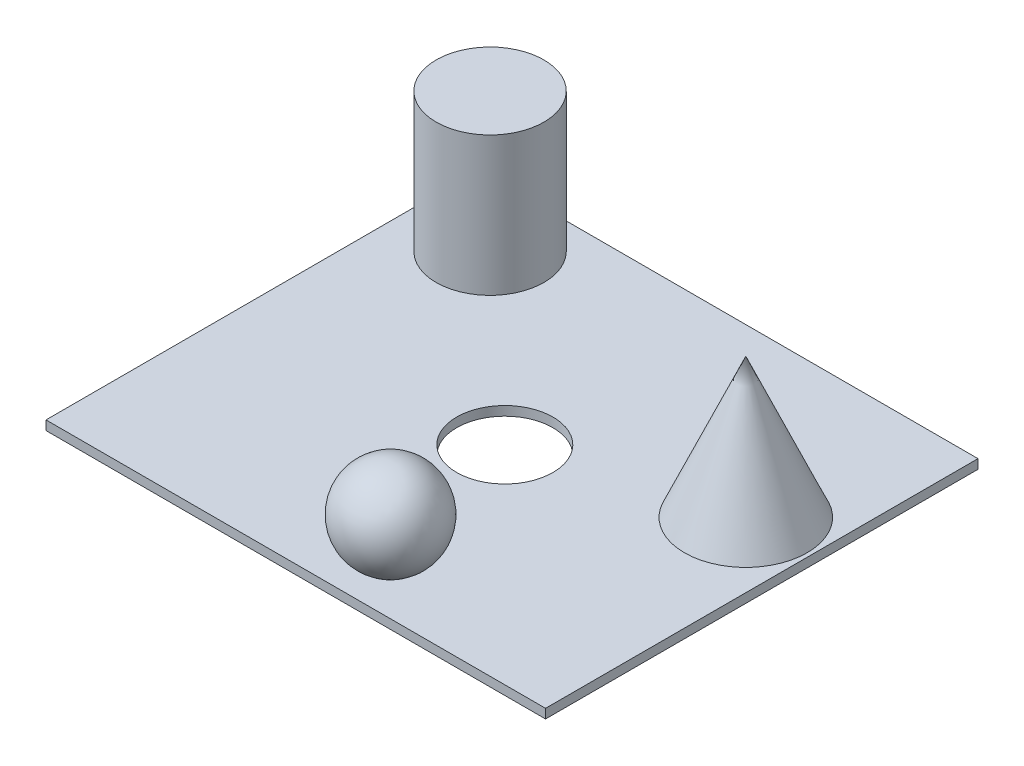
ISO-10303-21;
HEADER;
FILE_DESCRIPTION(('STEP AP214'),'2;1');
FILE_NAME('part.step','',(''),(''),'','','');
FILE_SCHEMA(('AUTOMOTIVE_DESIGN { 1 0 10303 214 1 1 1 1 }'));
ENDSEC;
DATA;
#1=APPLICATION_CONTEXT('core data for automotive mechanical design processes');
#2=APPLICATION_PROTOCOL_DEFINITION('international standard','automotive_design',2000,#1);
#3=PRODUCT_CONTEXT('',#1,'mechanical');
#4=PRODUCT('Part','Part','',(#3));
#5=PRODUCT_RELATED_PRODUCT_CATEGORY('part','',(#4));
#6=PRODUCT_DEFINITION_FORMATION('','',#4);
#7=PRODUCT_DEFINITION_CONTEXT('part definition',#1,'design');
#8=PRODUCT_DEFINITION('design','',#6,#7);
#9=PRODUCT_DEFINITION_SHAPE('','',#8);
#10=(LENGTH_UNIT() NAMED_UNIT(*) SI_UNIT(.MILLI.,.METRE.));
#11=(NAMED_UNIT(*) PLANE_ANGLE_UNIT() SI_UNIT($,.RADIAN.));
#12=(NAMED_UNIT(*) SI_UNIT($,.STERADIAN.) SOLID_ANGLE_UNIT());
#13=UNCERTAINTY_MEASURE_WITH_UNIT(LENGTH_MEASURE(1.E-05),#10,'distance_accuracy_value','');
#14=(GEOMETRIC_REPRESENTATION_CONTEXT(3) GLOBAL_UNCERTAINTY_ASSIGNED_CONTEXT((#13)) GLOBAL_UNIT_ASSIGNED_CONTEXT((#10,
#11,#12)) REPRESENTATION_CONTEXT('',''));
#15=CARTESIAN_POINT('',(0.,0.,0.));
#16=DIRECTION('',(0.,0.,1.));
#17=DIRECTION('',(1.,0.,0.));
#18=AXIS2_PLACEMENT_3D('',#15,#16,#17);
#19=CARTESIAN_POINT('',(-63.8958107096493,2.,-36.0505052227939));
#20=DIRECTION('',(1.,0.,0.));
#21=DIRECTION('',(0.,0.,-1.));
#22=AXIS2_PLACEMENT_3D('',#19,#20,#21);
#23=PLANE('',#22);
#24=DIRECTION('',(0.,0.,1.));
#25=VECTOR('',#24,1.);
#26=CARTESIAN_POINT('',(-63.8958107096493,0.,-36.0505052227939));
#27=LINE('',#26,#25);
#28=CARTESIAN_POINT('',(-63.8958107096493,0.,-36.0505052227939));
#29=VERTEX_POINT('',#28);
#30=CARTESIAN_POINT('',(-63.8958107096493,0.,57.349108792677));
#31=VERTEX_POINT('',#30);
#32=EDGE_CURVE('E115',#29,#31,#27,.T.);
#33=ORIENTED_EDGE('',*,*,#32,.T.);
#34=DIRECTION('',(0.,-1.,0.));
#35=VECTOR('',#34,1.);
#36=CARTESIAN_POINT('',(-63.8958107096493,2.,57.349108792677));
#37=LINE('',#36,#35);
#38=CARTESIAN_POINT('',(-63.8958107096493,2.,57.349108792677));
#39=VERTEX_POINT('',#38);
#40=EDGE_CURVE('E50',#39,#31,#37,.T.);
#41=ORIENTED_EDGE('',*,*,#40,.F.);
#42=DIRECTION('',(0.,0.,1.));
#43=VECTOR('',#42,1.);
#44=CARTESIAN_POINT('',(-63.8958107096493,2.,-36.0505052227939));
#45=LINE('',#44,#43);
#46=CARTESIAN_POINT('',(-63.8958107096493,2.,-36.0505052227939));
#47=VERTEX_POINT('',#46);
#48=EDGE_CURVE('E136',#47,#39,#45,.T.);
#49=ORIENTED_EDGE('',*,*,#48,.F.);
#50=DIRECTION('',(0.,-1.,0.));
#51=VECTOR('',#50,1.);
#52=CARTESIAN_POINT('',(-63.8958107096493,2.,-36.0505052227939));
#53=LINE('',#52,#51);
#54=EDGE_CURVE('E117',#47,#29,#53,.T.);
#55=ORIENTED_EDGE('',*,*,#54,.T.);
#56=EDGE_LOOP('',(#33,#41,#49,#55));
#57=FACE_BOUND('',#56,.T.);
#58=ADVANCED_FACE('F41',(#57),#23,.F.);
#59=CARTESIAN_POINT('',(-63.8958107096493,2.,57.349108792677));
#60=DIRECTION('',(0.,0.,-1.));
#61=DIRECTION('',(-1.,0.,0.));
#62=AXIS2_PLACEMENT_3D('',#59,#60,#61);
#63=PLANE('',#62);
#64=DIRECTION('',(1.,0.,0.));
#65=VECTOR('',#64,1.);
#66=CARTESIAN_POINT('',(-63.8958107096493,0.,57.349108792677));
#67=LINE('',#66,#65);
#68=CARTESIAN_POINT('',(43.9938368820536,0.,57.349108792677));
#69=VERTEX_POINT('',#68);
#70=EDGE_CURVE('E120',#31,#69,#67,.T.);
#71=ORIENTED_EDGE('',*,*,#70,.T.);
#72=DIRECTION('',(0.,-1.,0.));
#73=VECTOR('',#72,1.);
#74=CARTESIAN_POINT('',(43.9938368820536,2.,57.349108792677));
#75=LINE('',#74,#73);
#76=CARTESIAN_POINT('',(43.9938368820536,2.,57.349108792677));
#77=VERTEX_POINT('',#76);
#78=EDGE_CURVE('E142',#77,#69,#75,.T.);
#79=ORIENTED_EDGE('',*,*,#78,.F.);
#80=DIRECTION('',(1.,0.,0.));
#81=VECTOR('',#80,1.);
#82=CARTESIAN_POINT('',(-63.8958107096493,2.,57.349108792677));
#83=LINE('',#82,#81);
#84=EDGE_CURVE('E90',#39,#77,#83,.T.);
#85=ORIENTED_EDGE('',*,*,#84,.F.);
#86=ORIENTED_EDGE('',*,*,#40,.T.);
#87=EDGE_LOOP('',(#71,#79,#85,#86));
#88=FACE_BOUND('',#87,.T.);
#89=ADVANCED_FACE('F106',(#88),#63,.F.);
#90=CARTESIAN_POINT('',(43.9938368820536,2.,-36.0505052227939));
#91=DIRECTION('',(-1.,0.,0.));
#92=DIRECTION('',(0.,0.,1.));
#93=AXIS2_PLACEMENT_3D('',#90,#91,#92);
#94=PLANE('',#93);
#95=DIRECTION('',(0.,0.,-1.));
#96=VECTOR('',#95,1.);
#97=CARTESIAN_POINT('',(43.9938368820536,0.,-36.0505052227939));
#98=LINE('',#97,#96);
#99=CARTESIAN_POINT('',(43.9938368820536,0.,-36.0505052227939));
#100=VERTEX_POINT('',#99);
#101=EDGE_CURVE('E76',#69,#100,#98,.T.);
#102=ORIENTED_EDGE('',*,*,#101,.T.);
#103=DIRECTION('',(0.,-1.,0.));
#104=VECTOR('',#103,1.);
#105=CARTESIAN_POINT('',(43.9938368820536,2.,-36.0505052227939));
#106=LINE('',#105,#104);
#107=CARTESIAN_POINT('',(43.9938368820536,2.,-36.0505052227939));
#108=VERTEX_POINT('',#107);
#109=EDGE_CURVE('E139',#108,#100,#106,.T.);
#110=ORIENTED_EDGE('',*,*,#109,.F.);
#111=DIRECTION('',(0.,0.,-1.));
#112=VECTOR('',#111,1.);
#113=CARTESIAN_POINT('',(43.9938368820536,2.,-36.0505052227939));
#114=LINE('',#113,#112);
#115=EDGE_CURVE('E168',#77,#108,#114,.T.);
#116=ORIENTED_EDGE('',*,*,#115,.F.);
#117=ORIENTED_EDGE('',*,*,#78,.T.);
#118=EDGE_LOOP('',(#102,#110,#116,#117));
#119=FACE_BOUND('',#118,.T.);
#120=ADVANCED_FACE('F111',(#119),#94,.F.);
#121=CARTESIAN_POINT('',(-63.8958107096493,2.,-36.0505052227939));
#122=DIRECTION('',(0.,0.,1.));
#123=DIRECTION('',(1.,0.,0.));
#124=AXIS2_PLACEMENT_3D('',#121,#122,#123);
#125=PLANE('',#124);
#126=DIRECTION('',(-1.,0.,0.));
#127=VECTOR('',#126,1.);
#128=CARTESIAN_POINT('',(-63.8958107096493,0.,-36.0505052227939));
#129=LINE('',#128,#127);
#130=EDGE_CURVE('E82',#100,#29,#129,.T.);
#131=ORIENTED_EDGE('',*,*,#130,.T.);
#132=ORIENTED_EDGE('',*,*,#54,.F.);
#133=DIRECTION('',(-1.,0.,0.));
#134=VECTOR('',#133,1.);
#135=CARTESIAN_POINT('',(-63.8958107096493,2.,-36.0505052227939));
#136=LINE('',#135,#134);
#137=EDGE_CURVE('E58',#108,#47,#136,.T.);
#138=ORIENTED_EDGE('',*,*,#137,.F.);
#139=ORIENTED_EDGE('',*,*,#109,.T.);
#140=EDGE_LOOP('',(#131,#132,#138,#139));
#141=FACE_BOUND('',#140,.T.);
#142=ADVANCED_FACE('F173',(#141),#125,.F.);
#143=CARTESIAN_POINT('',(0.,2.,0.));
#144=DIRECTION('',(0.,1.,0.));
#145=DIRECTION('',(0.,0.,1.));
#146=AXIS2_PLACEMENT_3D('',#143,#144,#145);
#147=PLANE('',#146);
#148=CARTESIAN_POINT('',(29.8976798018366,2.,0.));
#149=DIRECTION('',(0.,1.,0.));
#150=DIRECTION('',(0.,0.,1.));
#151=AXIS2_PLACEMENT_3D('',#148,#149,#150);
#152=CIRCLE('',#151,13.2579210689235);
#153=CARTESIAN_POINT('',(29.8976798018366,2.,13.2579210689235));
#154=VERTEX_POINT('',#153);
#155=EDGE_CURVE('E11',#154,#154,#152,.T.);
#156=ORIENTED_EDGE('',*,*,#155,.F.);
#157=EDGE_LOOP('',(#156));
#158=FACE_BOUND('',#157,.T.);
#159=CARTESIAN_POINT('',(0.,2.,46.8320598774372));
#160=DIRECTION('',(0.,1.,0.));
#161=DIRECTION('',(0.,0.,1.));
#162=AXIS2_PLACEMENT_3D('',#159,#160,#161);
#163=CIRCLE('',#162,4.35889894354068);
#164=CARTESIAN_POINT('',(0.,2.,51.1909588209779));
#165=VERTEX_POINT('',#164);
#166=EDGE_CURVE('E157',#165,#165,#163,.T.);
#167=ORIENTED_EDGE('',*,*,#166,.F.);
#168=EDGE_LOOP('',(#167));
#169=FACE_BOUND('',#168,.T.);
#170=CARTESIAN_POINT('',(-9.69924096881529,2.,12.4534810573167));
#171=DIRECTION('',(0.,1.,0.));
#172=DIRECTION('',(0.,0.,1.));
#173=AXIS2_PLACEMENT_3D('',#170,#171,#172);
#174=CIRCLE('',#173,10.3882279474438);
#175=CARTESIAN_POINT('',(-9.69924096881529,2.,22.8417090047606));
#176=VERTEX_POINT('',#175);
#177=EDGE_CURVE('E149',#176,#176,#174,.T.);
#178=ORIENTED_EDGE('',*,*,#177,.F.);
#179=EDGE_LOOP('',(#178));
#180=FACE_BOUND('',#179,.T.);
#181=CARTESIAN_POINT('',(-47.4611327162016,2.,-22.1196287202904));
#182=DIRECTION('',(0.,1.,0.));
#183=DIRECTION('',(0.,0.,1.));
#184=AXIS2_PLACEMENT_3D('',#181,#182,#183);
#185=CIRCLE('',#184,11.6397529588326);
#186=CARTESIAN_POINT('',(-47.4611327162016,2.,-10.4798757614578));
#187=VERTEX_POINT('',#186);
#188=EDGE_CURVE('E127',#187,#187,#185,.T.);
#189=ORIENTED_EDGE('',*,*,#188,.F.);
#190=EDGE_LOOP('',(#189));
#191=FACE_BOUND('',#190,.T.);
#192=ORIENTED_EDGE('',*,*,#48,.T.);
#193=ORIENTED_EDGE('',*,*,#84,.T.);
#194=ORIENTED_EDGE('',*,*,#115,.T.);
#195=ORIENTED_EDGE('',*,*,#137,.T.);
#196=EDGE_LOOP('',(#192,#193,#194,#195));
#197=FACE_BOUND('',#196,.T.);
#198=ADVANCED_FACE('F172',(#158,#169,#180,#191,#197),#147,.T.);
#199=CARTESIAN_POINT('',(0.,0.,0.));
#200=DIRECTION('',(0.,1.,0.));
#201=DIRECTION('',(0.,0.,1.));
#202=AXIS2_PLACEMENT_3D('',#199,#200,#201);
#203=PLANE('',#202);
#204=CARTESIAN_POINT('',(-9.69924096881529,0.,12.4534810573167));
#205=DIRECTION('',(0.,1.,0.));
#206=DIRECTION('',(0.,0.,1.));
#207=AXIS2_PLACEMENT_3D('',#204,#205,#206);
#208=CIRCLE('',#207,10.3882279474438);
#209=CARTESIAN_POINT('',(-9.69924096881529,0.,22.8417090047606));
#210=VERTEX_POINT('',#209);
#211=EDGE_CURVE('E146',#210,#210,#208,.T.);
#212=ORIENTED_EDGE('',*,*,#211,.T.);
#213=EDGE_LOOP('',(#212));
#214=FACE_BOUND('',#213,.T.);
#215=ORIENTED_EDGE('',*,*,#32,.F.);
#216=ORIENTED_EDGE('',*,*,#130,.F.);
#217=ORIENTED_EDGE('',*,*,#101,.F.);
#218=ORIENTED_EDGE('',*,*,#70,.F.);
#219=EDGE_LOOP('',(#215,#216,#217,#218));
#220=FACE_BOUND('',#219,.T.);
#221=ADVANCED_FACE('F180',(#214,#220),#203,.F.);
#222=CARTESIAN_POINT('',(-47.4611327162016,32.,-22.1196287202904));
#223=DIRECTION('',(0.,-1.,0.));
#224=DIRECTION('',(0.,0.,-1.));
#225=AXIS2_PLACEMENT_3D('',#222,#223,#224);
#226=CYLINDRICAL_SURFACE('',#225,11.6397529588326);
#227=CARTESIAN_POINT('',(-47.4611327162016,32.,-22.1196287202904));
#228=DIRECTION('',(0.,1.,0.));
#229=DIRECTION('',(0.,0.,1.));
#230=AXIS2_PLACEMENT_3D('',#227,#228,#229);
#231=CIRCLE('',#230,11.6397529588326);
#232=CARTESIAN_POINT('',(-47.4611327162016,32.,-10.4798757614578));
#233=VERTEX_POINT('',#232);
#234=EDGE_CURVE('E121',#233,#233,#231,.T.);
#235=ORIENTED_EDGE('',*,*,#234,.F.);
#236=EDGE_LOOP('',(#235));
#237=FACE_BOUND('',#236,.T.);
#238=ORIENTED_EDGE('',*,*,#188,.T.);
#239=EDGE_LOOP('',(#238));
#240=FACE_BOUND('',#239,.T.);
#241=ADVANCED_FACE('F186',(#237,#240),#226,.T.);
#242=CARTESIAN_POINT('',(-47.4611327162016,32.,-22.1196287202904));
#243=DIRECTION('',(0.,1.,0.));
#244=DIRECTION('',(0.,0.,1.));
#245=AXIS2_PLACEMENT_3D('',#242,#243,#244);
#246=PLANE('',#245);
#247=ORIENTED_EDGE('',*,*,#234,.T.);
#248=EDGE_LOOP('',(#247));
#249=FACE_BOUND('',#248,.T.);
#250=ADVANCED_FACE('F190',(#249),#246,.T.);
#251=CARTESIAN_POINT('',(-9.69924096881529,-28.,12.4534810573167));
#252=DIRECTION('',(0.,1.,0.));
#253=DIRECTION('',(0.,0.,1.));
#254=AXIS2_PLACEMENT_3D('',#251,#252,#253);
#255=CYLINDRICAL_SURFACE('',#254,10.3882279474438);
#256=ORIENTED_EDGE('',*,*,#177,.T.);
#257=EDGE_LOOP('',(#256));
#258=FACE_BOUND('',#257,.T.);
#259=ORIENTED_EDGE('',*,*,#211,.F.);
#260=EDGE_LOOP('',(#259));
#261=FACE_BOUND('',#260,.T.);
#262=ADVANCED_FACE('F102',(#258,#261),#255,.F.);
#263=CARTESIAN_POINT('',(0.,11.,46.8320598774372));
#264=DIRECTION('',(0.,1.,0.));
#265=DIRECTION('',(0.,0.,-1.));
#266=AXIS2_PLACEMENT_3D('',#263,#264,#265);
#267=SPHERICAL_SURFACE('',#266,10.);
#268=ORIENTED_EDGE('',*,*,#166,.T.);
#269=EDGE_LOOP('',(#268));
#270=FACE_BOUND('',#269,.T.);
#271=ADVANCED_FACE('F96',(#270),#267,.T.);
#272=CARTESIAN_POINT('',(29.8976798018366,32.1417061601864,0.));
#273=DIRECTION('',(0.,-1.,0.));
#274=DIRECTION('',(0.,0.,-1.));
#275=AXIS2_PLACEMENT_3D('',#272,#273,#274);
#276=CONICAL_SURFACE('',#275,0.,0.41438374413405);
#277=ORIENTED_EDGE('',*,*,#155,.T.);
#278=EDGE_LOOP('',(#277));
#279=FACE_BOUND('',#278,.T.);
#280=CARTESIAN_POINT('',(29.8976798018366,32.1417061601864,0.));
#281=VERTEX_POINT('',#280);
#282=VERTEX_LOOP('',#281);
#283=FACE_BOUND('',#282,.T.);
#284=ADVANCED_FACE('F94',(#279,#283),#276,.T.);
#285=CLOSED_SHELL('',(#58,#89,#120,#142,#198,#221,#241,#250,#262,#271,#284));
#286=MANIFOLD_SOLID_BREP('B2',#285);
#287=ADVANCED_BREP_SHAPE_REPRESENTATION('',(#18,#286),#14);
#288=SHAPE_DEFINITION_REPRESENTATION(#9,#287);
ENDSEC;
END-ISO-10303-21;
